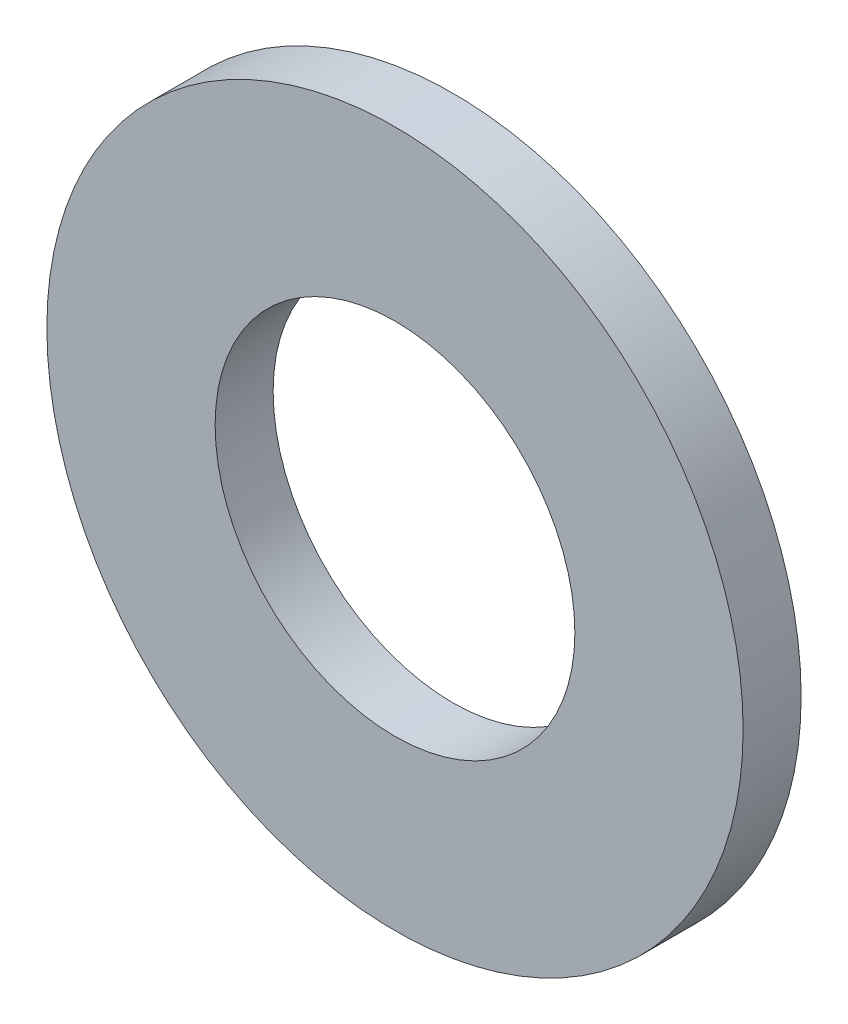
ISO-10303-21;
HEADER;
FILE_DESCRIPTION(('STEP AP214'),'2;1');
FILE_NAME('part.step','',(''),(''),'','','');
FILE_SCHEMA(('AUTOMOTIVE_DESIGN { 1 0 10303 214 1 1 1 1 }'));
ENDSEC;
DATA;
#1=APPLICATION_CONTEXT('core data for automotive mechanical design processes');
#2=APPLICATION_PROTOCOL_DEFINITION('international standard','automotive_design',2000,#1);
#3=PRODUCT_CONTEXT('',#1,'mechanical');
#4=PRODUCT('Part','Part','',(#3));
#5=PRODUCT_RELATED_PRODUCT_CATEGORY('part','',(#4));
#6=PRODUCT_DEFINITION_FORMATION('','',#4);
#7=PRODUCT_DEFINITION_CONTEXT('part definition',#1,'design');
#8=PRODUCT_DEFINITION('design','',#6,#7);
#9=PRODUCT_DEFINITION_SHAPE('','',#8);
#10=(LENGTH_UNIT() NAMED_UNIT(*) SI_UNIT(.MILLI.,.METRE.));
#11=(NAMED_UNIT(*) PLANE_ANGLE_UNIT() SI_UNIT($,.RADIAN.));
#12=(NAMED_UNIT(*) SI_UNIT($,.STERADIAN.) SOLID_ANGLE_UNIT());
#13=UNCERTAINTY_MEASURE_WITH_UNIT(LENGTH_MEASURE(1.E-05),#10,'distance_accuracy_value','');
#14=(GEOMETRIC_REPRESENTATION_CONTEXT(3) GLOBAL_UNCERTAINTY_ASSIGNED_CONTEXT((#13)) GLOBAL_UNIT_ASSIGNED_CONTEXT((#10,
#11,#12)) REPRESENTATION_CONTEXT('',''));
#15=CARTESIAN_POINT('',(0.,0.,0.));
#16=DIRECTION('',(0.,0.,1.));
#17=DIRECTION('',(1.,0.,0.));
#18=AXIS2_PLACEMENT_3D('',#15,#16,#17);
#19=CARTESIAN_POINT('',(0.,0.,1.5875));
#20=DIRECTION('',(0.,0.,1.));
#21=DIRECTION('',(1.,0.,0.));
#22=AXIS2_PLACEMENT_3D('',#19,#20,#21);
#23=PLANE('',#22);
#24=CARTESIAN_POINT('',(0.,0.,1.5875));
#25=DIRECTION('',(0.,0.,1.));
#26=DIRECTION('',(1.,0.,0.));
#27=AXIS2_PLACEMENT_3D('',#24,#25,#26);
#28=CIRCLE('',#27,9.525);
#29=CARTESIAN_POINT('',(9.525,0.,1.5875));
#30=VERTEX_POINT('',#29);
#31=EDGE_CURVE('E10',#30,#30,#28,.T.);
#32=ORIENTED_EDGE('',*,*,#31,.T.);
#33=EDGE_LOOP('',(#32));
#34=FACE_BOUND('',#33,.T.);
#35=CARTESIAN_POINT('',(0.,0.,1.5875));
#36=DIRECTION('',(0.,0.,1.));
#37=DIRECTION('',(1.,0.,0.));
#38=AXIS2_PLACEMENT_3D('',#35,#36,#37);
#39=CIRCLE('',#38,4.92125);
#40=CARTESIAN_POINT('',(4.92125,0.,1.5875));
#41=VERTEX_POINT('',#40);
#42=EDGE_CURVE('E43',#41,#41,#39,.T.);
#43=ORIENTED_EDGE('',*,*,#42,.F.);
#44=EDGE_LOOP('',(#43));
#45=FACE_BOUND('',#44,.T.);
#46=ADVANCED_FACE('F32',(#34,#45),#23,.T.);
#47=CARTESIAN_POINT('',(0.,0.,0.));
#48=DIRECTION('',(0.,0.,1.));
#49=DIRECTION('',(1.,0.,0.));
#50=AXIS2_PLACEMENT_3D('',#47,#48,#49);
#51=PLANE('',#50);
#52=CARTESIAN_POINT('',(0.,0.,0.));
#53=DIRECTION('',(0.,0.,1.));
#54=DIRECTION('',(1.,0.,0.));
#55=AXIS2_PLACEMENT_3D('',#52,#53,#54);
#56=CIRCLE('',#55,9.525);
#57=CARTESIAN_POINT('',(9.525,0.,0.));
#58=VERTEX_POINT('',#57);
#59=EDGE_CURVE('E39',#58,#58,#56,.T.);
#60=ORIENTED_EDGE('',*,*,#59,.F.);
#61=EDGE_LOOP('',(#60));
#62=FACE_BOUND('',#61,.T.);
#63=CARTESIAN_POINT('',(0.,0.,0.));
#64=DIRECTION('',(0.,0.,1.));
#65=DIRECTION('',(1.,0.,0.));
#66=AXIS2_PLACEMENT_3D('',#63,#64,#65);
#67=CIRCLE('',#66,4.92125);
#68=CARTESIAN_POINT('',(4.92125,0.,0.));
#69=VERTEX_POINT('',#68);
#70=EDGE_CURVE('E47',#69,#69,#67,.T.);
#71=ORIENTED_EDGE('',*,*,#70,.T.);
#72=EDGE_LOOP('',(#71));
#73=FACE_BOUND('',#72,.T.);
#74=ADVANCED_FACE('F53',(#62,#73),#51,.F.);
#75=CARTESIAN_POINT('',(0.,0.,1.5875));
#76=DIRECTION('',(0.,0.,-1.));
#77=DIRECTION('',(-1.,0.,0.));
#78=AXIS2_PLACEMENT_3D('',#75,#76,#77);
#79=CYLINDRICAL_SURFACE('',#78,9.525);
#80=ORIENTED_EDGE('',*,*,#31,.F.);
#81=EDGE_LOOP('',(#80));
#82=FACE_BOUND('',#81,.T.);
#83=ORIENTED_EDGE('',*,*,#59,.T.);
#84=EDGE_LOOP('',(#83));
#85=FACE_BOUND('',#84,.T.);
#86=ADVANCED_FACE('F34',(#82,#85),#79,.T.);
#87=CARTESIAN_POINT('',(0.,0.,1.5875));
#88=DIRECTION('',(0.,0.,-1.));
#89=DIRECTION('',(-1.,0.,0.));
#90=AXIS2_PLACEMENT_3D('',#87,#88,#89);
#91=CYLINDRICAL_SURFACE('',#90,4.92125);
#92=ORIENTED_EDGE('',*,*,#42,.T.);
#93=EDGE_LOOP('',(#92));
#94=FACE_BOUND('',#93,.T.);
#95=ORIENTED_EDGE('',*,*,#70,.F.);
#96=EDGE_LOOP('',(#95));
#97=FACE_BOUND('',#96,.T.);
#98=ADVANCED_FACE('F55',(#94,#97),#91,.F.);
#99=CLOSED_SHELL('',(#46,#74,#86,#98));
#100=MANIFOLD_SOLID_BREP('B2',#99);
#101=ADVANCED_BREP_SHAPE_REPRESENTATION('',(#18,#100),#14);
#102=SHAPE_DEFINITION_REPRESENTATION(#9,#101);
ENDSEC;
END-ISO-10303-21;
